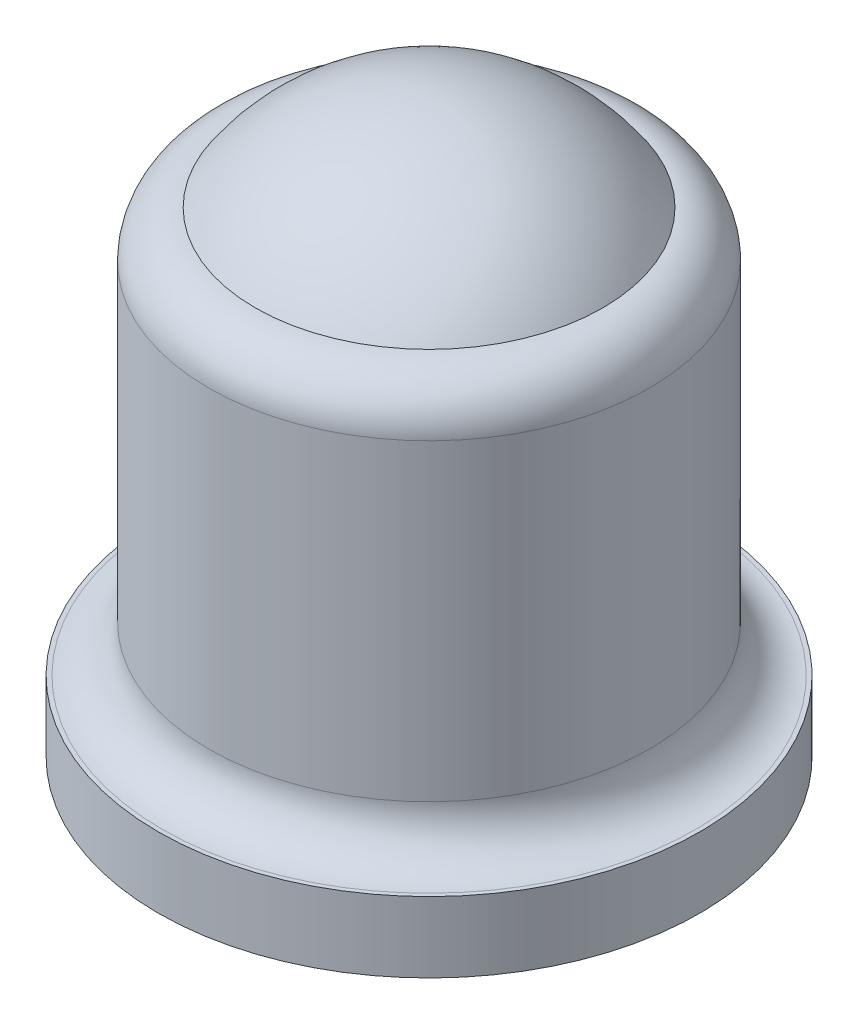
ISO-10303-21;
HEADER;
FILE_DESCRIPTION(('STEP AP214'),'2;1');
FILE_NAME('part.step','',(''),(''),'','','');
FILE_SCHEMA(('AUTOMOTIVE_DESIGN { 1 0 10303 214 1 1 1 1 }'));
ENDSEC;
DATA;
#1=APPLICATION_CONTEXT('core data for automotive mechanical design processes');
#2=APPLICATION_PROTOCOL_DEFINITION('international standard','automotive_design',2000,#1);
#3=PRODUCT_CONTEXT('',#1,'mechanical');
#4=PRODUCT('Part','Part','',(#3));
#5=PRODUCT_RELATED_PRODUCT_CATEGORY('part','',(#4));
#6=PRODUCT_DEFINITION_FORMATION('','',#4);
#7=PRODUCT_DEFINITION_CONTEXT('part definition',#1,'design');
#8=PRODUCT_DEFINITION('design','',#6,#7);
#9=PRODUCT_DEFINITION_SHAPE('','',#8);
#10=(LENGTH_UNIT() NAMED_UNIT(*) SI_UNIT(.MILLI.,.METRE.));
#11=(NAMED_UNIT(*) PLANE_ANGLE_UNIT() SI_UNIT($,.RADIAN.));
#12=(NAMED_UNIT(*) SI_UNIT($,.STERADIAN.) SOLID_ANGLE_UNIT());
#13=UNCERTAINTY_MEASURE_WITH_UNIT(LENGTH_MEASURE(1.E-05),#10,'distance_accuracy_value','');
#14=(GEOMETRIC_REPRESENTATION_CONTEXT(3) GLOBAL_UNCERTAINTY_ASSIGNED_CONTEXT((#13)) GLOBAL_UNIT_ASSIGNED_CONTEXT((#10,
#11,#12)) REPRESENTATION_CONTEXT('',''));
#15=CARTESIAN_POINT('',(0.,0.,0.));
#16=DIRECTION('',(0.,0.,1.));
#17=DIRECTION('',(1.,0.,0.));
#18=AXIS2_PLACEMENT_3D('',#15,#16,#17);
#19=CARTESIAN_POINT('',(0.,5.13,0.));
#20=DIRECTION('',(0.,1.,0.));
#21=DIRECTION('',(0.,0.,1.));
#22=AXIS2_PLACEMENT_3D('',#19,#20,#21);
#23=PLANE('',#22);
#24=CARTESIAN_POINT('',(0.,5.13,0.));
#25=DIRECTION('',(0.,1.,0.));
#26=DIRECTION('',(0.,0.,1.));
#27=AXIS2_PLACEMENT_3D('',#24,#25,#26);
#28=CIRCLE('',#27,1.875);
#29=CARTESIAN_POINT('',(0.,5.13,1.875));
#30=VERTEX_POINT('',#29);
#31=EDGE_CURVE('E47',#30,#30,#28,.T.);
#32=ORIENTED_EDGE('',*,*,#31,.T.);
#33=EDGE_LOOP('',(#32));
#34=FACE_BOUND('',#33,.T.);
#35=ADVANCED_FACE('F44',(#34),#23,.T.);
#36=CARTESIAN_POINT('',(0.,0.76,0.));
#37=DIRECTION('',(0.,1.,0.));
#38=DIRECTION('',(0.,0.,1.));
#39=AXIS2_PLACEMENT_3D('',#36,#37,#38);
#40=PLANE('',#39);
#41=CARTESIAN_POINT('',(0.,0.76,0.));
#42=DIRECTION('',(0.,1.,0.));
#43=DIRECTION('',(0.,0.,1.));
#44=AXIS2_PLACEMENT_3D('',#41,#42,#43);
#45=CIRCLE('',#44,2.875);
#46=CARTESIAN_POINT('',(0.,0.76,2.875));
#47=VERTEX_POINT('',#46);
#48=EDGE_CURVE('E63',#47,#47,#45,.F.);
#49=ORIENTED_EDGE('',*,*,#48,.T.);
#50=EDGE_LOOP('',(#49));
#51=FACE_BOUND('',#50,.T.);
#52=CARTESIAN_POINT('',(0.,0.76,0.));
#53=DIRECTION('',(0.,1.,0.));
#54=DIRECTION('',(0.,0.,1.));
#55=AXIS2_PLACEMENT_3D('',#52,#53,#54);
#56=CIRCLE('',#55,2.92);
#57=CARTESIAN_POINT('',(0.,0.76,2.92));
#58=VERTEX_POINT('',#57);
#59=EDGE_CURVE('E51',#58,#58,#56,.T.);
#60=ORIENTED_EDGE('',*,*,#59,.T.);
#61=EDGE_LOOP('',(#60));
#62=FACE_BOUND('',#61,.T.);
#63=ADVANCED_FACE('F84',(#51,#62),#40,.T.);
#64=CARTESIAN_POINT('',(0.,0.76,0.));
#65=DIRECTION('',(0.,-1.,0.));
#66=DIRECTION('',(0.,0.,-1.));
#67=AXIS2_PLACEMENT_3D('',#64,#65,#66);
#68=CYLINDRICAL_SURFACE('',#67,2.92);
#69=ORIENTED_EDGE('',*,*,#59,.F.);
#70=EDGE_LOOP('',(#69));
#71=FACE_BOUND('',#70,.T.);
#72=CARTESIAN_POINT('',(0.,0.,0.));
#73=DIRECTION('',(0.,1.,0.));
#74=DIRECTION('',(0.,0.,1.));
#75=AXIS2_PLACEMENT_3D('',#72,#73,#74);
#76=CIRCLE('',#75,2.92);
#77=CARTESIAN_POINT('',(0.,0.,2.92));
#78=VERTEX_POINT('',#77);
#79=EDGE_CURVE('E12',#78,#78,#76,.T.);
#80=ORIENTED_EDGE('',*,*,#79,.T.);
#81=EDGE_LOOP('',(#80));
#82=FACE_BOUND('',#81,.T.);
#83=ADVANCED_FACE('F86',(#71,#82),#68,.T.);
#84=CARTESIAN_POINT('',(0.,0.,0.));
#85=DIRECTION('',(0.,1.,0.));
#86=DIRECTION('',(0.,0.,1.));
#87=AXIS2_PLACEMENT_3D('',#84,#85,#86);
#88=PLANE('',#87);
#89=ORIENTED_EDGE('',*,*,#79,.F.);
#90=EDGE_LOOP('',(#89));
#91=FACE_BOUND('',#90,.T.);
#92=ADVANCED_FACE('F91',(#91),#88,.F.);
#93=CARTESIAN_POINT('',(0.,5.13,0.));
#94=DIRECTION('',(0.,-1.,0.));
#95=DIRECTION('',(0.,0.,-1.));
#96=AXIS2_PLACEMENT_3D('',#93,#94,#95);
#97=CYLINDRICAL_SURFACE('',#96,2.375);
#98=CARTESIAN_POINT('',(0.,1.26,0.));
#99=DIRECTION('',(0.,1.,0.));
#100=DIRECTION('',(0.,0.,1.));
#101=AXIS2_PLACEMENT_3D('',#98,#99,#100);
#102=CIRCLE('',#101,2.375);
#103=CARTESIAN_POINT('',(0.,1.26,2.375));
#104=VERTEX_POINT('',#103);
#105=EDGE_CURVE('E60',#104,#104,#102,.T.);
#106=ORIENTED_EDGE('',*,*,#105,.T.);
#107=EDGE_LOOP('',(#106));
#108=FACE_BOUND('',#107,.T.);
#109=CARTESIAN_POINT('',(0.,4.63,0.));
#110=DIRECTION('',(0.,1.,0.));
#111=DIRECTION('',(0.,0.,1.));
#112=AXIS2_PLACEMENT_3D('',#109,#110,#111);
#113=CIRCLE('',#112,2.375);
#114=CARTESIAN_POINT('',(0.,4.63,2.375));
#115=VERTEX_POINT('',#114);
#116=EDGE_CURVE('E56',#115,#115,#113,.F.);
#117=ORIENTED_EDGE('',*,*,#116,.T.);
#118=EDGE_LOOP('',(#117));
#119=FACE_BOUND('',#118,.T.);
#120=ADVANCED_FACE('F79',(#108,#119),#97,.T.);
#121=CARTESIAN_POINT('',(0.,1.26,0.));
#122=DIRECTION('',(0.,1.,0.));
#123=DIRECTION('',(0.,0.,1.));
#124=AXIS2_PLACEMENT_3D('',#121,#122,#123);
#125=TOROIDAL_SURFACE('',#124,2.875,0.5);
#126=ORIENTED_EDGE('',*,*,#48,.F.);
#127=EDGE_LOOP('',(#126));
#128=FACE_BOUND('',#127,.T.);
#129=ORIENTED_EDGE('',*,*,#105,.F.);
#130=EDGE_LOOP('',(#129));
#131=FACE_BOUND('',#130,.T.);
#132=ADVANCED_FACE('F73',(#128,#131),#125,.F.);
#133=CARTESIAN_POINT('',(0.,4.63,0.));
#134=DIRECTION('',(0.,1.,0.));
#135=DIRECTION('',(0.,0.,1.));
#136=AXIS2_PLACEMENT_3D('',#133,#134,#135);
#137=TOROIDAL_SURFACE('',#136,1.875,0.5);
#138=ORIENTED_EDGE('',*,*,#116,.F.);
#139=EDGE_LOOP('',(#138));
#140=FACE_BOUND('',#139,.T.);
#141=ORIENTED_EDGE('',*,*,#31,.F.);
#142=EDGE_LOOP('',(#141));
#143=FACE_BOUND('',#142,.T.);
#144=ADVANCED_FACE('F71',(#140,#143),#137,.T.);
#145=CLOSED_SHELL('',(#35,#63,#83,#92,#120,#132,#144));
#146=MANIFOLD_SOLID_BREP('B2',#145);
#147=CARTESIAN_POINT('',(0.,5.13,0.));
#148=DIRECTION('',(0.,1.,0.));
#149=DIRECTION('',(0.,0.,1.));
#150=AXIS2_PLACEMENT_3D('',#147,#148,#149);
#151=PLANE('',#150);
#152=CARTESIAN_POINT('',(0.,5.13,0.));
#153=DIRECTION('',(0.,1.,0.));
#154=DIRECTION('',(0.,0.,1.));
#155=AXIS2_PLACEMENT_3D('',#152,#153,#154);
#156=CIRCLE('',#155,1.875);
#157=CARTESIAN_POINT('',(0.,5.13,1.875));
#158=VERTEX_POINT('',#157);
#159=EDGE_CURVE('E43',#158,#158,#156,.T.);
#160=ORIENTED_EDGE('',*,*,#159,.F.);
#161=EDGE_LOOP('',(#160));
#162=FACE_BOUND('',#161,.T.);
#163=ADVANCED_FACE('F145',(#162),#151,.F.);
#164=CARTESIAN_POINT('',(0.,3.8721875,0.));
#165=DIRECTION('',(0.,0.,1.));
#166=DIRECTION('',(1.,0.,0.));
#167=AXIS2_PLACEMENT_3D('',#164,#165,#166);
#168=SPHERICAL_SURFACE('',#167,2.2578125);
#169=CARTESIAN_POINT('',(0.,3.8721875,0.));
#170=DIRECTION('',(0.,1.,0.));
#171=DIRECTION('',(0.,0.,1.));
#172=AXIS2_PLACEMENT_3D('',#169,#170,#171);
#173=SPHERICAL_SURFACE('',#172,2.2578125);
#174=ORIENTED_EDGE('',*,*,#159,.T.);
#175=EDGE_LOOP('',(#174));
#176=FACE_BOUND('',#175,.T.);
#177=ADVANCED_FACE('F152',(#176),#173,.T.);
#178=CLOSED_SHELL('',(#163,#177));
#179=MANIFOLD_SOLID_BREP('B7',#178);
#180=ADVANCED_BREP_SHAPE_REPRESENTATION('',(#18,#146,#179),#14);
#181=SHAPE_DEFINITION_REPRESENTATION(#9,#180);
ENDSEC;
END-ISO-10303-21;
